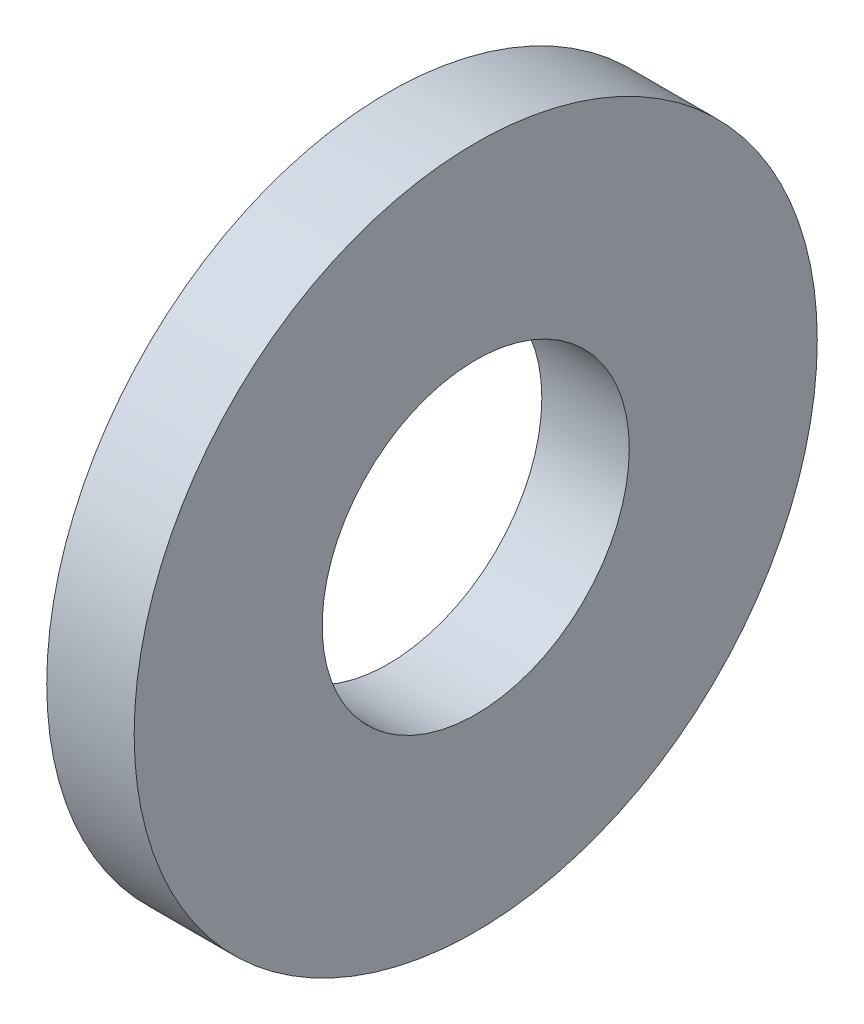
ISO-10303-21;
HEADER;
FILE_DESCRIPTION(('STEP AP214'),'2;1');
FILE_NAME('part.step','',(''),(''),'','','');
FILE_SCHEMA(('AUTOMOTIVE_DESIGN { 1 0 10303 214 1 1 1 1 }'));
ENDSEC;
DATA;
#1=APPLICATION_CONTEXT('core data for automotive mechanical design processes');
#2=APPLICATION_PROTOCOL_DEFINITION('international standard','automotive_design',2000,#1);
#3=PRODUCT_CONTEXT('',#1,'mechanical');
#4=PRODUCT('Part','Part','',(#3));
#5=PRODUCT_RELATED_PRODUCT_CATEGORY('part','',(#4));
#6=PRODUCT_DEFINITION_FORMATION('','',#4);
#7=PRODUCT_DEFINITION_CONTEXT('part definition',#1,'design');
#8=PRODUCT_DEFINITION('design','',#6,#7);
#9=PRODUCT_DEFINITION_SHAPE('','',#8);
#10=(LENGTH_UNIT() NAMED_UNIT(*) SI_UNIT(.MILLI.,.METRE.));
#11=(NAMED_UNIT(*) PLANE_ANGLE_UNIT() SI_UNIT($,.RADIAN.));
#12=(NAMED_UNIT(*) SI_UNIT($,.STERADIAN.) SOLID_ANGLE_UNIT());
#13=UNCERTAINTY_MEASURE_WITH_UNIT(LENGTH_MEASURE(1.E-05),#10,'distance_accuracy_value','');
#14=(GEOMETRIC_REPRESENTATION_CONTEXT(3) GLOBAL_UNCERTAINTY_ASSIGNED_CONTEXT((#13)) GLOBAL_UNIT_ASSIGNED_CONTEXT((#10,
#11,#12)) REPRESENTATION_CONTEXT('',''));
#15=CARTESIAN_POINT('',(0.,0.,0.));
#16=DIRECTION('',(0.,0.,1.));
#17=DIRECTION('',(1.,0.,0.));
#18=AXIS2_PLACEMENT_3D('',#15,#16,#17);
#19=CARTESIAN_POINT('',(2.03200000000012,0.,1.66533453693773E-13));
#20=DIRECTION('',(1.,0.,0.));
#21=DIRECTION('',(0.,0.,-1.00000000000001));
#22=AXIS2_PLACEMENT_3D('',#19,#20,#21);
#23=PLANE('',#22);
#24=CARTESIAN_POINT('',(2.03200000000012,0.,1.66533453693773E-13));
#25=DIRECTION('',(1.,0.,0.));
#26=DIRECTION('',(0.,0.,-1.00000000000001));
#27=AXIS2_PLACEMENT_3D('',#24,#25,#26);
#28=CIRCLE('',#27,7.9375);
#29=CARTESIAN_POINT('',(2.03200000000012,0.,-7.9374999999999));
#30=VERTEX_POINT('',#29);
#31=EDGE_CURVE('E10',#30,#30,#28,.T.);
#32=ORIENTED_EDGE('',*,*,#31,.T.);
#33=EDGE_LOOP('',(#32));
#34=FACE_BOUND('',#33,.T.);
#35=CARTESIAN_POINT('',(2.03200000000012,0.,1.66533453693773E-13));
#36=DIRECTION('',(1.,0.,0.));
#37=DIRECTION('',(0.,0.,-1.00000000000001));
#38=AXIS2_PLACEMENT_3D('',#35,#36,#37);
#39=CIRCLE('',#38,3.5687);
#40=CARTESIAN_POINT('',(2.03200000000012,0.,-3.56869999999986));
#41=VERTEX_POINT('',#40);
#42=EDGE_CURVE('E43',#41,#41,#39,.T.);
#43=ORIENTED_EDGE('',*,*,#42,.F.);
#44=EDGE_LOOP('',(#43));
#45=FACE_BOUND('',#44,.T.);
#46=ADVANCED_FACE('F32',(#34,#45),#23,.T.);
#47=CARTESIAN_POINT('',(0.,0.,0.));
#48=DIRECTION('',(1.,0.,0.));
#49=DIRECTION('',(0.,0.,-1.00000000000001));
#50=AXIS2_PLACEMENT_3D('',#47,#48,#49);
#51=PLANE('',#50);
#52=CARTESIAN_POINT('',(0.,0.,0.));
#53=DIRECTION('',(1.,0.,0.));
#54=DIRECTION('',(0.,0.,-1.00000000000001));
#55=AXIS2_PLACEMENT_3D('',#52,#53,#54);
#56=CIRCLE('',#55,7.9375);
#57=CARTESIAN_POINT('',(0.,0.,-7.93750000000007));
#58=VERTEX_POINT('',#57);
#59=EDGE_CURVE('E36',#58,#58,#56,.T.);
#60=ORIENTED_EDGE('',*,*,#59,.F.);
#61=EDGE_LOOP('',(#60));
#62=FACE_BOUND('',#61,.T.);
#63=CARTESIAN_POINT('',(0.,0.,0.));
#64=DIRECTION('',(1.,0.,0.));
#65=DIRECTION('',(0.,0.,-1.00000000000001));
#66=AXIS2_PLACEMENT_3D('',#63,#64,#65);
#67=CIRCLE('',#66,3.5687);
#68=CARTESIAN_POINT('',(0.,0.,-3.56870000000003));
#69=VERTEX_POINT('',#68);
#70=EDGE_CURVE('E45',#69,#69,#67,.T.);
#71=ORIENTED_EDGE('',*,*,#70,.T.);
#72=EDGE_LOOP('',(#71));
#73=FACE_BOUND('',#72,.T.);
#74=ADVANCED_FACE('F55',(#62,#73),#51,.F.);
#75=CARTESIAN_POINT('',(2.03200000000012,0.,1.66533453693773E-13));
#76=DIRECTION('',(-1.,0.,0.));
#77=DIRECTION('',(0.,0.,1.00000000000001));
#78=AXIS2_PLACEMENT_3D('',#75,#76,#77);
#79=CYLINDRICAL_SURFACE('',#78,7.9375);
#80=ORIENTED_EDGE('',*,*,#31,.F.);
#81=EDGE_LOOP('',(#80));
#82=FACE_BOUND('',#81,.T.);
#83=ORIENTED_EDGE('',*,*,#59,.T.);
#84=EDGE_LOOP('',(#83));
#85=FACE_BOUND('',#84,.T.);
#86=ADVANCED_FACE('F34',(#82,#85),#79,.T.);
#87=CARTESIAN_POINT('',(2.03200000000012,0.,1.66533453693773E-13));
#88=DIRECTION('',(-1.,0.,0.));
#89=DIRECTION('',(0.,0.,1.00000000000001));
#90=AXIS2_PLACEMENT_3D('',#87,#88,#89);
#91=CYLINDRICAL_SURFACE('',#90,3.5687);
#92=ORIENTED_EDGE('',*,*,#42,.T.);
#93=EDGE_LOOP('',(#92));
#94=FACE_BOUND('',#93,.T.);
#95=ORIENTED_EDGE('',*,*,#70,.F.);
#96=EDGE_LOOP('',(#95));
#97=FACE_BOUND('',#96,.T.);
#98=ADVANCED_FACE('F51',(#94,#97),#91,.F.);
#99=CLOSED_SHELL('',(#46,#74,#86,#98));
#100=MANIFOLD_SOLID_BREP('B2',#99);
#101=ADVANCED_BREP_SHAPE_REPRESENTATION('',(#18,#100),#14);
#102=SHAPE_DEFINITION_REPRESENTATION(#9,#101);
ENDSEC;
END-ISO-10303-21;
